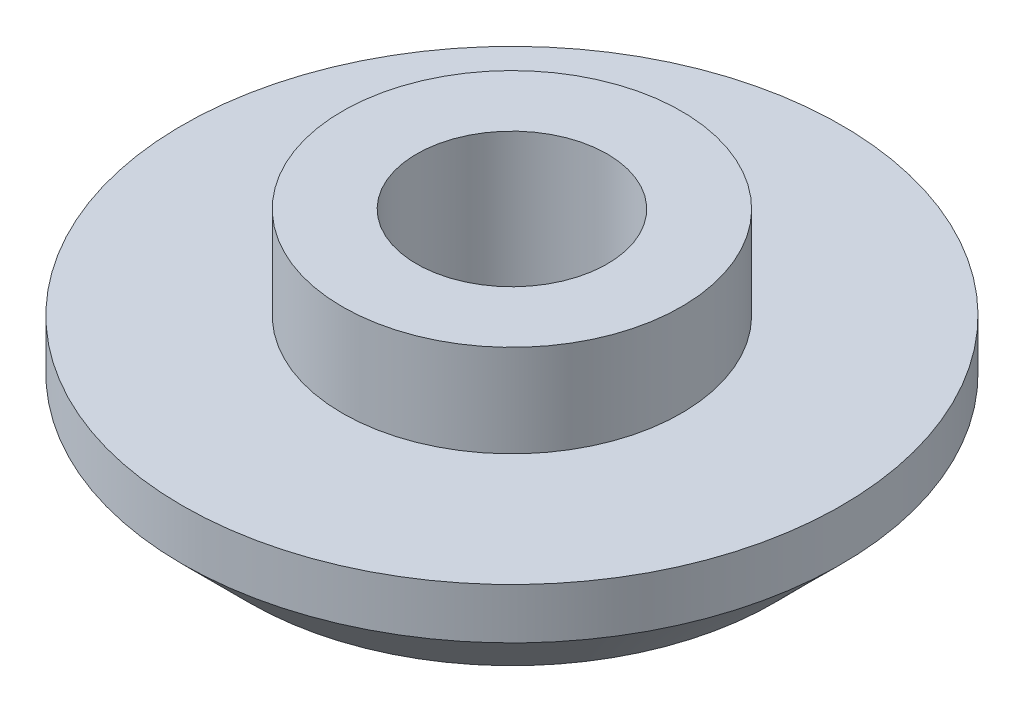
ISO-10303-21;
HEADER;
FILE_DESCRIPTION(('STEP AP214'),'2;1');
FILE_NAME('part.step','',(''),(''),'','','');
FILE_SCHEMA(('AUTOMOTIVE_DESIGN { 1 0 10303 214 1 1 1 1 }'));
ENDSEC;
DATA;
#1=APPLICATION_CONTEXT('core data for automotive mechanical design processes');
#2=APPLICATION_PROTOCOL_DEFINITION('international standard','automotive_design',2000,#1);
#3=PRODUCT_CONTEXT('',#1,'mechanical');
#4=PRODUCT('Part','Part','',(#3));
#5=PRODUCT_RELATED_PRODUCT_CATEGORY('part','',(#4));
#6=PRODUCT_DEFINITION_FORMATION('','',#4);
#7=PRODUCT_DEFINITION_CONTEXT('part definition',#1,'design');
#8=PRODUCT_DEFINITION('design','',#6,#7);
#9=PRODUCT_DEFINITION_SHAPE('','',#8);
#10=(LENGTH_UNIT() NAMED_UNIT(*) SI_UNIT(.MILLI.,.METRE.));
#11=(NAMED_UNIT(*) PLANE_ANGLE_UNIT() SI_UNIT($,.RADIAN.));
#12=(NAMED_UNIT(*) SI_UNIT($,.STERADIAN.) SOLID_ANGLE_UNIT());
#13=UNCERTAINTY_MEASURE_WITH_UNIT(LENGTH_MEASURE(1.E-05),#10,'distance_accuracy_value','');
#14=(GEOMETRIC_REPRESENTATION_CONTEXT(3) GLOBAL_UNCERTAINTY_ASSIGNED_CONTEXT((#13)) GLOBAL_UNIT_ASSIGNED_CONTEXT((#10,
#11,#12)) REPRESENTATION_CONTEXT('',''));
#15=CARTESIAN_POINT('',(0.,0.,0.));
#16=DIRECTION('',(0.,0.,1.));
#17=DIRECTION('',(1.,0.,0.));
#18=AXIS2_PLACEMENT_3D('',#15,#16,#17);
#19=CARTESIAN_POINT('',(3.5,0.,0.));
#20=DIRECTION('',(0.,1.,0.));
#21=DIRECTION('',(0.,0.,1.));
#22=AXIS2_PLACEMENT_3D('',#19,#20,#21);
#23=PLANE('',#22);
#24=CARTESIAN_POINT('',(0.,0.,0.));
#25=DIRECTION('',(0.,1.,0.));
#26=DIRECTION('',(0.,0.,1.));
#27=AXIS2_PLACEMENT_3D('',#24,#25,#26);
#28=CIRCLE('',#27,5.5);
#29=CARTESIAN_POINT('',(0.,0.,5.5));
#30=VERTEX_POINT('',#29);
#31=EDGE_CURVE('E10',#30,#30,#28,.T.);
#32=ORIENTED_EDGE('',*,*,#31,.F.);
#33=EDGE_LOOP('',(#32));
#34=FACE_BOUND('',#33,.T.);
#35=CARTESIAN_POINT('',(0.,0.,0.));
#36=DIRECTION('',(0.,1.,0.));
#37=DIRECTION('',(0.,0.,1.));
#38=AXIS2_PLACEMENT_3D('',#35,#36,#37);
#39=CIRCLE('',#38,3.5);
#40=CARTESIAN_POINT('',(0.,0.,3.5));
#41=VERTEX_POINT('',#40);
#42=EDGE_CURVE('E62',#41,#41,#39,.T.);
#43=ORIENTED_EDGE('',*,*,#42,.T.);
#44=EDGE_LOOP('',(#43));
#45=FACE_BOUND('',#44,.T.);
#46=ADVANCED_FACE('F37',(#34,#45),#23,.F.);
#47=CARTESIAN_POINT('',(0.,0.,0.));
#48=DIRECTION('',(0.,1.,0.));
#49=DIRECTION('',(0.,0.,1.));
#50=AXIS2_PLACEMENT_3D('',#47,#48,#49);
#51=CONICAL_SURFACE('',#50,5.5,0.785398163397447);
#52=CARTESIAN_POINT('',(0.,1.4142135623731,0.));
#53=DIRECTION('',(0.,1.,0.));
#54=DIRECTION('',(0.,0.,1.));
#55=AXIS2_PLACEMENT_3D('',#52,#53,#54);
#56=CIRCLE('',#55,6.91421356237309);
#57=CARTESIAN_POINT('',(0.,1.4142135623731,6.91421356237309));
#58=VERTEX_POINT('',#57);
#59=EDGE_CURVE('E43',#58,#58,#56,.T.);
#60=ORIENTED_EDGE('',*,*,#59,.F.);
#61=EDGE_LOOP('',(#60));
#62=FACE_BOUND('',#61,.T.);
#63=ORIENTED_EDGE('',*,*,#31,.T.);
#64=EDGE_LOOP('',(#63));
#65=FACE_BOUND('',#64,.T.);
#66=ADVANCED_FACE('F97',(#62,#65),#51,.T.);
#67=CARTESIAN_POINT('',(0.,4.41,0.));
#68=DIRECTION('',(0.,1.,0.));
#69=DIRECTION('',(0.,0.,1.));
#70=AXIS2_PLACEMENT_3D('',#67,#68,#69);
#71=CYLINDRICAL_SURFACE('',#70,6.91421356237309);
#72=CARTESIAN_POINT('',(0.,2.47539707516277,0.));
#73=DIRECTION('',(0.,1.,0.));
#74=DIRECTION('',(0.,0.,1.));
#75=AXIS2_PLACEMENT_3D('',#72,#73,#74);
#76=CIRCLE('',#75,6.91421356237309);
#77=CARTESIAN_POINT('',(0.,2.47539707516277,6.91421356237309));
#78=VERTEX_POINT('',#77);
#79=EDGE_CURVE('E47',#78,#78,#76,.T.);
#80=ORIENTED_EDGE('',*,*,#79,.F.);
#81=EDGE_LOOP('',(#80));
#82=FACE_BOUND('',#81,.T.);
#83=ORIENTED_EDGE('',*,*,#59,.T.);
#84=EDGE_LOOP('',(#83));
#85=FACE_BOUND('',#84,.T.);
#86=ADVANCED_FACE('F102',(#82,#85),#71,.T.);
#87=CARTESIAN_POINT('',(3.556,2.47539707516277,0.));
#88=DIRECTION('',(0.,-1.,0.));
#89=DIRECTION('',(0.,0.,-1.));
#90=AXIS2_PLACEMENT_3D('',#87,#88,#89);
#91=PLANE('',#90);
#92=CARTESIAN_POINT('',(0.,2.47539707516277,0.));
#93=DIRECTION('',(0.,1.,0.));
#94=DIRECTION('',(0.,0.,1.));
#95=AXIS2_PLACEMENT_3D('',#92,#93,#94);
#96=CIRCLE('',#95,3.556);
#97=CARTESIAN_POINT('',(0.,2.47539707516277,3.556));
#98=VERTEX_POINT('',#97);
#99=EDGE_CURVE('E51',#98,#98,#96,.T.);
#100=ORIENTED_EDGE('',*,*,#99,.F.);
#101=EDGE_LOOP('',(#100));
#102=FACE_BOUND('',#101,.T.);
#103=ORIENTED_EDGE('',*,*,#79,.T.);
#104=EDGE_LOOP('',(#103));
#105=FACE_BOUND('',#104,.T.);
#106=ADVANCED_FACE('F108',(#102,#105),#91,.F.);
#107=CARTESIAN_POINT('',(0.,4.41,0.));
#108=DIRECTION('',(0.,1.,0.));
#109=DIRECTION('',(0.,0.,1.));
#110=AXIS2_PLACEMENT_3D('',#107,#108,#109);
#111=CYLINDRICAL_SURFACE('',#110,3.556);
#112=CARTESIAN_POINT('',(0.,4.41,0.));
#113=DIRECTION('',(0.,1.,0.));
#114=DIRECTION('',(0.,0.,1.));
#115=AXIS2_PLACEMENT_3D('',#112,#113,#114);
#116=CIRCLE('',#115,3.556);
#117=CARTESIAN_POINT('',(0.,4.41,3.556));
#118=VERTEX_POINT('',#117);
#119=EDGE_CURVE('E56',#118,#118,#116,.T.);
#120=ORIENTED_EDGE('',*,*,#119,.F.);
#121=EDGE_LOOP('',(#120));
#122=FACE_BOUND('',#121,.T.);
#123=ORIENTED_EDGE('',*,*,#99,.T.);
#124=EDGE_LOOP('',(#123));
#125=FACE_BOUND('',#124,.T.);
#126=ADVANCED_FACE('F114',(#122,#125),#111,.T.);
#127=CARTESIAN_POINT('',(0.,4.41,0.));
#128=DIRECTION('',(0.,-1.,0.));
#129=DIRECTION('',(0.,0.,-1.));
#130=AXIS2_PLACEMENT_3D('',#127,#128,#129);
#131=PLANE('',#130);
#132=CARTESIAN_POINT('',(0.,4.41,0.));
#133=DIRECTION('',(0.,-1.,0.));
#134=DIRECTION('',(0.,0.,-1.));
#135=AXIS2_PLACEMENT_3D('',#132,#133,#134);
#136=CIRCLE('',#135,2.);
#137=CARTESIAN_POINT('',(0.,4.41,-2.));
#138=VERTEX_POINT('',#137);
#139=EDGE_CURVE('E65',#138,#138,#136,.T.);
#140=ORIENTED_EDGE('',*,*,#139,.T.);
#141=EDGE_LOOP('',(#140));
#142=FACE_BOUND('',#141,.T.);
#143=ORIENTED_EDGE('',*,*,#119,.T.);
#144=EDGE_LOOP('',(#143));
#145=FACE_BOUND('',#144,.T.);
#146=ADVANCED_FACE('F72',(#142,#145),#131,.F.);
#147=CARTESIAN_POINT('',(0.,0.6,0.));
#148=DIRECTION('',(0.,1.,0.));
#149=DIRECTION('',(0.,0.,1.));
#150=AXIS2_PLACEMENT_3D('',#147,#148,#149);
#151=PLANE('',#150);
#152=CARTESIAN_POINT('',(0.,0.6,0.));
#153=DIRECTION('',(0.,-1.,0.));
#154=DIRECTION('',(0.,0.,-1.));
#155=AXIS2_PLACEMENT_3D('',#152,#153,#154);
#156=CIRCLE('',#155,2.);
#157=CARTESIAN_POINT('',(0.,0.6,-2.));
#158=VERTEX_POINT('',#157);
#159=EDGE_CURVE('E66',#158,#158,#156,.T.);
#160=ORIENTED_EDGE('',*,*,#159,.F.);
#161=EDGE_LOOP('',(#160));
#162=FACE_BOUND('',#161,.T.);
#163=CARTESIAN_POINT('',(0.,0.6,0.));
#164=DIRECTION('',(0.,1.,0.));
#165=DIRECTION('',(0.,0.,1.));
#166=AXIS2_PLACEMENT_3D('',#163,#164,#165);
#167=CIRCLE('',#166,3.5);
#168=CARTESIAN_POINT('',(0.,0.6,3.5));
#169=VERTEX_POINT('',#168);
#170=EDGE_CURVE('E59',#169,#169,#167,.T.);
#171=ORIENTED_EDGE('',*,*,#170,.F.);
#172=EDGE_LOOP('',(#171));
#173=FACE_BOUND('',#172,.T.);
#174=ADVANCED_FACE('F82',(#162,#173),#151,.F.);
#175=CARTESIAN_POINT('',(0.,4.41,0.));
#176=DIRECTION('',(0.,1.,0.));
#177=DIRECTION('',(0.,0.,1.));
#178=AXIS2_PLACEMENT_3D('',#175,#176,#177);
#179=CYLINDRICAL_SURFACE('',#178,3.5);
#180=ORIENTED_EDGE('',*,*,#42,.F.);
#181=EDGE_LOOP('',(#180));
#182=FACE_BOUND('',#181,.T.);
#183=ORIENTED_EDGE('',*,*,#170,.T.);
#184=EDGE_LOOP('',(#183));
#185=FACE_BOUND('',#184,.T.);
#186=ADVANCED_FACE('F78',(#182,#185),#179,.F.);
#187=CARTESIAN_POINT('',(0.,4.41,0.));
#188=DIRECTION('',(0.,-1.,0.));
#189=DIRECTION('',(0.,0.,-1.));
#190=AXIS2_PLACEMENT_3D('',#187,#188,#189);
#191=CYLINDRICAL_SURFACE('',#190,2.);
#192=ORIENTED_EDGE('',*,*,#139,.F.);
#193=EDGE_LOOP('',(#192));
#194=FACE_BOUND('',#193,.T.);
#195=ORIENTED_EDGE('',*,*,#159,.T.);
#196=EDGE_LOOP('',(#195));
#197=FACE_BOUND('',#196,.T.);
#198=ADVANCED_FACE('F75',(#194,#197),#191,.F.);
#199=CLOSED_SHELL('',(#46,#66,#86,#106,#126,#146,#174,#186,#198));
#200=MANIFOLD_SOLID_BREP('B2',#199);
#201=ADVANCED_BREP_SHAPE_REPRESENTATION('',(#18,#200),#14);
#202=SHAPE_DEFINITION_REPRESENTATION(#9,#201);
ENDSEC;
END-ISO-10303-21;
